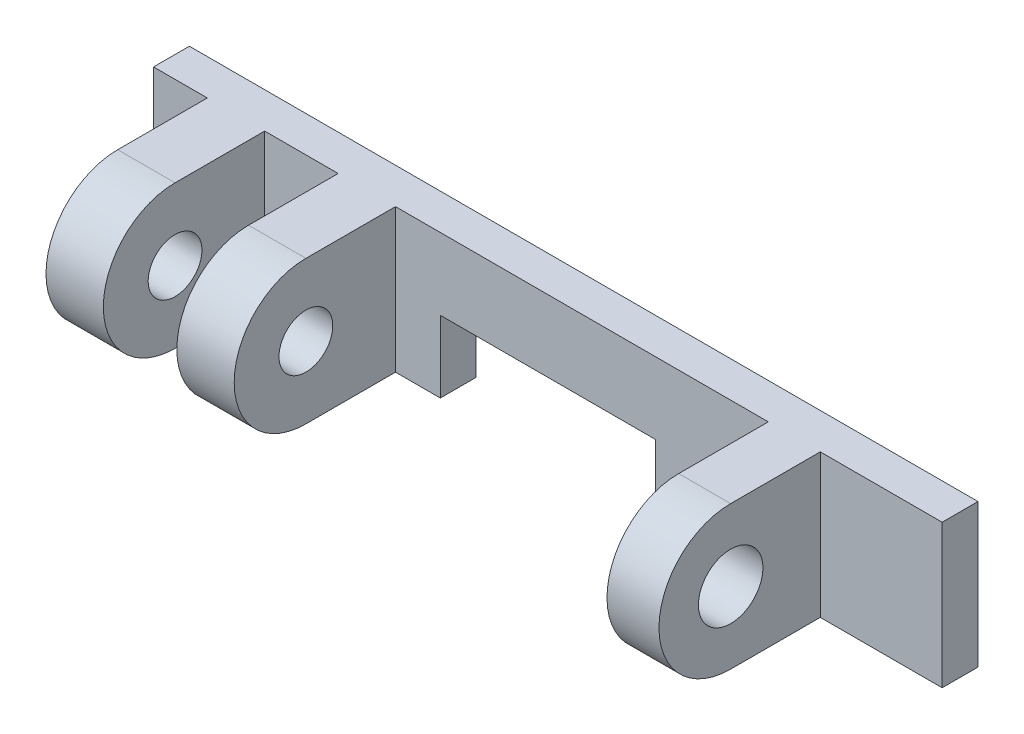
ISO-10303-21;
HEADER;
FILE_DESCRIPTION(('STEP AP214'),'2;1');
FILE_NAME('part.step','',(''),(''),'','','');
FILE_SCHEMA(('AUTOMOTIVE_DESIGN { 1 0 10303 214 1 1 1 1 }'));
ENDSEC;
DATA;
#1=APPLICATION_CONTEXT('core data for automotive mechanical design processes');
#2=APPLICATION_PROTOCOL_DEFINITION('international standard','automotive_design',2000,#1);
#3=PRODUCT_CONTEXT('',#1,'mechanical');
#4=PRODUCT('Part','Part','',(#3));
#5=PRODUCT_RELATED_PRODUCT_CATEGORY('part','',(#4));
#6=PRODUCT_DEFINITION_FORMATION('','',#4);
#7=PRODUCT_DEFINITION_CONTEXT('part definition',#1,'design');
#8=PRODUCT_DEFINITION('design','',#6,#7);
#9=PRODUCT_DEFINITION_SHAPE('','',#8);
#10=(LENGTH_UNIT() NAMED_UNIT(*) SI_UNIT(.MILLI.,.METRE.));
#11=(NAMED_UNIT(*) PLANE_ANGLE_UNIT() SI_UNIT($,.RADIAN.));
#12=(NAMED_UNIT(*) SI_UNIT($,.STERADIAN.) SOLID_ANGLE_UNIT());
#13=UNCERTAINTY_MEASURE_WITH_UNIT(LENGTH_MEASURE(1.E-05),#10,'distance_accuracy_value','');
#14=(GEOMETRIC_REPRESENTATION_CONTEXT(3) GLOBAL_UNCERTAINTY_ASSIGNED_CONTEXT((#13)) GLOBAL_UNIT_ASSIGNED_CONTEXT((#10,
#11,#12)) REPRESENTATION_CONTEXT('',''));
#15=CARTESIAN_POINT('',(0.,0.,0.));
#16=DIRECTION('',(0.,0.,1.));
#17=DIRECTION('',(1.,0.,0.));
#18=AXIS2_PLACEMENT_3D('',#15,#16,#17);
#19=CARTESIAN_POINT('',(-11.,0.,-2.5));
#20=DIRECTION('',(0.,0.,1.));
#21=DIRECTION('',(1.,0.,0.));
#22=AXIS2_PLACEMENT_3D('',#19,#20,#21);
#23=PLANE('',#22);
#24=DIRECTION('',(1.,0.,0.));
#25=VECTOR('',#24,1.);
#26=CARTESIAN_POINT('',(-11.,-2.,-2.5));
#27=LINE('',#26,#25);
#28=CARTESIAN_POINT('',(-4.25,-2.,-2.5));
#29=VERTEX_POINT('',#28);
#30=CARTESIAN_POINT('',(-3.,-2.,-2.5));
#31=VERTEX_POINT('',#30);
#32=EDGE_CURVE('E195',#29,#31,#27,.T.);
#33=ORIENTED_EDGE('',*,*,#32,.T.);
#34=DIRECTION('',(0.,-1.,0.));
#35=VECTOR('',#34,1.);
#36=CARTESIAN_POINT('',(-3.,0.,-2.5));
#37=LINE('',#36,#35);
#38=CARTESIAN_POINT('',(-3.,0.,-2.5));
#39=VERTEX_POINT('',#38);
#40=EDGE_CURVE('E187',#39,#31,#37,.T.);
#41=ORIENTED_EDGE('',*,*,#40,.F.);
#42=DIRECTION('',(1.,0.,0.));
#43=VECTOR('',#42,1.);
#44=CARTESIAN_POINT('',(-3.,0.,-2.5));
#45=LINE('',#44,#43);
#46=CARTESIAN_POINT('',(3.,0.,-2.5));
#47=VERTEX_POINT('',#46);
#48=EDGE_CURVE('E175',#39,#47,#45,.T.);
#49=ORIENTED_EDGE('',*,*,#48,.T.);
#50=DIRECTION('',(0.,-1.,0.));
#51=VECTOR('',#50,1.);
#52=CARTESIAN_POINT('',(3.,0.,-2.5));
#53=LINE('',#52,#51);
#54=CARTESIAN_POINT('',(3.,-2.,-2.5));
#55=VERTEX_POINT('',#54);
#56=EDGE_CURVE('E202',#47,#55,#53,.T.);
#57=ORIENTED_EDGE('',*,*,#56,.T.);
#58=CARTESIAN_POINT('',(6.15,-2.,-2.5));
#59=VERTEX_POINT('',#58);
#60=EDGE_CURVE('E39',#55,#59,#27,.T.);
#61=ORIENTED_EDGE('',*,*,#60,.T.);
#62=DIRECTION('',(0.,-1.,0.));
#63=VECTOR('',#62,1.);
#64=CARTESIAN_POINT('',(6.15,0.,-2.5));
#65=LINE('',#64,#63);
#66=CARTESIAN_POINT('',(6.15,2.,-2.5));
#67=VERTEX_POINT('',#66);
#68=EDGE_CURVE('E61',#67,#59,#65,.T.);
#69=ORIENTED_EDGE('',*,*,#68,.F.);
#70=DIRECTION('',(1.,0.,0.));
#71=VECTOR('',#70,1.);
#72=CARTESIAN_POINT('',(-11.,2.,-2.5));
#73=LINE('',#72,#71);
#74=CARTESIAN_POINT('',(-4.25,2.,-2.5));
#75=VERTEX_POINT('',#74);
#76=EDGE_CURVE('E302',#75,#67,#73,.T.);
#77=ORIENTED_EDGE('',*,*,#76,.F.);
#78=DIRECTION('',(0.,-1.,0.));
#79=VECTOR('',#78,1.);
#80=CARTESIAN_POINT('',(-4.25,0.,-2.5));
#81=LINE('',#80,#79);
#82=EDGE_CURVE('E247',#75,#29,#81,.T.);
#83=ORIENTED_EDGE('',*,*,#82,.T.);
#84=EDGE_LOOP('',(#33,#41,#49,#57,#61,#69,#77,#83));
#85=FACE_BOUND('',#84,.T.);
#86=ADVANCED_FACE('F35',(#85),#23,.T.);
#87=CARTESIAN_POINT('',(-7.9,-2.,0.));
#88=DIRECTION('',(0.,-1.,0.));
#89=DIRECTION('',(0.,0.,-1.));
#90=AXIS2_PLACEMENT_3D('',#87,#88,#89);
#91=PLANE('',#90);
#92=DIRECTION('',(1.,0.,0.));
#93=VECTOR('',#92,1.);
#94=CARTESIAN_POINT('',(-11.,-2.,-3.5));
#95=LINE('',#94,#93);
#96=CARTESIAN_POINT('',(-11.,-2.,-3.5));
#97=VERTEX_POINT('',#96);
#98=CARTESIAN_POINT('',(-3.,-2.,-3.5));
#99=VERTEX_POINT('',#98);
#100=EDGE_CURVE('E311',#97,#99,#95,.T.);
#101=ORIENTED_EDGE('',*,*,#100,.T.);
#102=DIRECTION('',(0.,0.,1.));
#103=VECTOR('',#102,1.);
#104=CARTESIAN_POINT('',(-3.,-2.,0.));
#105=LINE('',#104,#103);
#106=EDGE_CURVE('E196',#99,#31,#105,.T.);
#107=ORIENTED_EDGE('',*,*,#106,.T.);
#108=ORIENTED_EDGE('',*,*,#32,.F.);
#109=DIRECTION('',(0.,0.,1.));
#110=VECTOR('',#109,1.);
#111=CARTESIAN_POINT('',(-4.25,-2.,0.));
#112=LINE('',#111,#110);
#113=CARTESIAN_POINT('',(-4.25,-2.,0.));
#114=VERTEX_POINT('',#113);
#115=EDGE_CURVE('E244',#29,#114,#112,.T.);
#116=ORIENTED_EDGE('',*,*,#115,.T.);
#117=DIRECTION('',(-1.,0.,0.));
#118=VECTOR('',#117,1.);
#119=CARTESIAN_POINT('',(-4.25,-2.,0.));
#120=LINE('',#119,#118);
#121=CARTESIAN_POINT('',(-5.85,-2.,0.));
#122=VERTEX_POINT('',#121);
#123=EDGE_CURVE('E252',#114,#122,#120,.T.);
#124=ORIENTED_EDGE('',*,*,#123,.T.);
#125=DIRECTION('',(0.,0.,1.));
#126=VECTOR('',#125,1.);
#127=CARTESIAN_POINT('',(-5.85,-2.,0.));
#128=LINE('',#127,#126);
#129=CARTESIAN_POINT('',(-5.85,-2.,-2.5));
#130=VERTEX_POINT('',#129);
#131=EDGE_CURVE('E257',#130,#122,#128,.T.);
#132=ORIENTED_EDGE('',*,*,#131,.F.);
#133=CARTESIAN_POINT('',(-7.9,-2.,-2.5));
#134=VERTEX_POINT('',#133);
#135=EDGE_CURVE('E309',#134,#130,#27,.T.);
#136=ORIENTED_EDGE('',*,*,#135,.F.);
#137=DIRECTION('',(0.,0.,1.));
#138=VECTOR('',#137,1.);
#139=CARTESIAN_POINT('',(-7.9,-2.,0.));
#140=LINE('',#139,#138);
#141=CARTESIAN_POINT('',(-7.9,-2.,0.));
#142=VERTEX_POINT('',#141);
#143=EDGE_CURVE('E338',#134,#142,#140,.T.);
#144=ORIENTED_EDGE('',*,*,#143,.T.);
#145=DIRECTION('',(-1.,0.,0.));
#146=VECTOR('',#145,1.);
#147=CARTESIAN_POINT('',(-7.9,-2.,0.));
#148=LINE('',#147,#146);
#149=CARTESIAN_POINT('',(-9.5,-2.,0.));
#150=VERTEX_POINT('',#149);
#151=EDGE_CURVE('E45',#142,#150,#148,.T.);
#152=ORIENTED_EDGE('',*,*,#151,.T.);
#153=DIRECTION('',(0.,0.,1.));
#154=VECTOR('',#153,1.);
#155=CARTESIAN_POINT('',(-9.5,-2.,0.));
#156=LINE('',#155,#154);
#157=CARTESIAN_POINT('',(-9.5,-2.,-2.5));
#158=VERTEX_POINT('',#157);
#159=EDGE_CURVE('E359',#158,#150,#156,.T.);
#160=ORIENTED_EDGE('',*,*,#159,.F.);
#161=CARTESIAN_POINT('',(-11.,-2.,-2.5));
#162=VERTEX_POINT('',#161);
#163=EDGE_CURVE('E318',#162,#158,#27,.T.);
#164=ORIENTED_EDGE('',*,*,#163,.F.);
#165=DIRECTION('',(0.,0.,1.));
#166=VECTOR('',#165,1.);
#167=CARTESIAN_POINT('',(-11.,-2.,0.));
#168=LINE('',#167,#166);
#169=EDGE_CURVE('E272',#97,#162,#168,.T.);
#170=ORIENTED_EDGE('',*,*,#169,.F.);
#171=EDGE_LOOP('',(#101,#107,#108,#116,#124,#132,#136,#144,#152,#160,#164,#170));
#172=FACE_BOUND('',#171,.T.);
#173=ADVANCED_FACE('F337',(#172),#91,.T.);
#174=CARTESIAN_POINT('',(-11.,0.,-3.5));
#175=DIRECTION('',(0.,0.,1.));
#176=DIRECTION('',(1.,0.,0.));
#177=AXIS2_PLACEMENT_3D('',#174,#175,#176);
#178=PLANE('',#177);
#179=DIRECTION('',(0.,-1.,0.));
#180=VECTOR('',#179,1.);
#181=CARTESIAN_POINT('',(-3.,0.,-3.5));
#182=LINE('',#181,#180);
#183=CARTESIAN_POINT('',(-3.,0.,-3.5));
#184=VERTEX_POINT('',#183);
#185=EDGE_CURVE('E183',#184,#99,#182,.T.);
#186=ORIENTED_EDGE('',*,*,#185,.T.);
#187=ORIENTED_EDGE('',*,*,#100,.F.);
#188=DIRECTION('',(0.,-1.,0.));
#189=VECTOR('',#188,1.);
#190=CARTESIAN_POINT('',(-11.,0.,-3.5));
#191=LINE('',#190,#189);
#192=CARTESIAN_POINT('',(-11.,2.,-3.5));
#193=VERTEX_POINT('',#192);
#194=EDGE_CURVE('E275',#193,#97,#191,.T.);
#195=ORIENTED_EDGE('',*,*,#194,.F.);
#196=DIRECTION('',(1.,0.,0.));
#197=VECTOR('',#196,1.);
#198=CARTESIAN_POINT('',(-11.,2.,-3.5));
#199=LINE('',#198,#197);
#200=CARTESIAN_POINT('',(11.,2.,-3.5));
#201=VERTEX_POINT('',#200);
#202=EDGE_CURVE('E291',#193,#201,#199,.T.);
#203=ORIENTED_EDGE('',*,*,#202,.T.);
#204=DIRECTION('',(0.,-1.,0.));
#205=VECTOR('',#204,1.);
#206=CARTESIAN_POINT('',(11.,0.,-3.5));
#207=LINE('',#206,#205);
#208=CARTESIAN_POINT('',(11.,-2.,-3.5));
#209=VERTEX_POINT('',#208);
#210=EDGE_CURVE('E285',#201,#209,#207,.T.);
#211=ORIENTED_EDGE('',*,*,#210,.T.);
#212=CARTESIAN_POINT('',(3.,-2.,-3.5));
#213=VERTEX_POINT('',#212);
#214=EDGE_CURVE('E320',#213,#209,#95,.T.);
#215=ORIENTED_EDGE('',*,*,#214,.F.);
#216=DIRECTION('',(0.,-1.,0.));
#217=VECTOR('',#216,1.);
#218=CARTESIAN_POINT('',(3.,0.,-3.5));
#219=LINE('',#218,#217);
#220=CARTESIAN_POINT('',(3.,0.,-3.5));
#221=VERTEX_POINT('',#220);
#222=EDGE_CURVE('E190',#221,#213,#219,.T.);
#223=ORIENTED_EDGE('',*,*,#222,.F.);
#224=DIRECTION('',(1.,0.,0.));
#225=VECTOR('',#224,1.);
#226=CARTESIAN_POINT('',(-3.,0.,-3.5));
#227=LINE('',#226,#225);
#228=EDGE_CURVE('E182',#184,#221,#227,.T.);
#229=ORIENTED_EDGE('',*,*,#228,.F.);
#230=EDGE_LOOP('',(#186,#187,#195,#203,#211,#215,#223,#229));
#231=FACE_BOUND('',#230,.T.);
#232=ADVANCED_FACE('F407',(#231),#178,.F.);
#233=ORIENTED_EDGE('',*,*,#135,.T.);
#234=DIRECTION('',(0.,-1.,0.));
#235=VECTOR('',#234,1.);
#236=CARTESIAN_POINT('',(-5.85,0.,-2.5));
#237=LINE('',#236,#235);
#238=CARTESIAN_POINT('',(-5.85,2.,-2.5));
#239=VERTEX_POINT('',#238);
#240=EDGE_CURVE('E260',#239,#130,#237,.T.);
#241=ORIENTED_EDGE('',*,*,#240,.F.);
#242=CARTESIAN_POINT('',(-7.9,2.,-2.5));
#243=VERTEX_POINT('',#242);
#244=EDGE_CURVE('E296',#243,#239,#73,.T.);
#245=ORIENTED_EDGE('',*,*,#244,.F.);
#246=DIRECTION('',(0.,-1.,0.));
#247=VECTOR('',#246,1.);
#248=CARTESIAN_POINT('',(-7.9,0.,-2.5));
#249=LINE('',#248,#247);
#250=EDGE_CURVE('E333',#243,#134,#249,.T.);
#251=ORIENTED_EDGE('',*,*,#250,.T.);
#252=EDGE_LOOP('',(#233,#241,#245,#251));
#253=FACE_BOUND('',#252,.T.);
#254=ADVANCED_FACE('F329',(#253),#23,.T.);
#255=CARTESIAN_POINT('',(-7.9,2.,0.));
#256=DIRECTION('',(0.,1.,0.));
#257=DIRECTION('',(0.,0.,1.));
#258=AXIS2_PLACEMENT_3D('',#255,#256,#257);
#259=PLANE('',#258);
#260=DIRECTION('',(0.,0.,-1.));
#261=VECTOR('',#260,1.);
#262=CARTESIAN_POINT('',(-9.5,2.,0.));
#263=LINE('',#262,#261);
#264=CARTESIAN_POINT('',(-9.5,2.,0.));
#265=VERTEX_POINT('',#264);
#266=CARTESIAN_POINT('',(-9.5,2.,-2.5));
#267=VERTEX_POINT('',#266);
#268=EDGE_CURVE('E351',#265,#267,#263,.T.);
#269=ORIENTED_EDGE('',*,*,#268,.F.);
#270=DIRECTION('',(-1.,0.,0.));
#271=VECTOR('',#270,1.);
#272=CARTESIAN_POINT('',(-7.9,2.,0.));
#273=LINE('',#272,#271);
#274=CARTESIAN_POINT('',(-7.9,2.,0.));
#275=VERTEX_POINT('',#274);
#276=EDGE_CURVE('E11',#275,#265,#273,.T.);
#277=ORIENTED_EDGE('',*,*,#276,.F.);
#278=DIRECTION('',(0.,0.,-1.));
#279=VECTOR('',#278,1.);
#280=CARTESIAN_POINT('',(-7.9,2.,0.));
#281=LINE('',#280,#279);
#282=EDGE_CURVE('E349',#275,#243,#281,.T.);
#283=ORIENTED_EDGE('',*,*,#282,.T.);
#284=ORIENTED_EDGE('',*,*,#244,.T.);
#285=DIRECTION('',(0.,0.,-1.));
#286=VECTOR('',#285,1.);
#287=CARTESIAN_POINT('',(-5.85,2.,0.));
#288=LINE('',#287,#286);
#289=CARTESIAN_POINT('',(-5.85,2.,0.));
#290=VERTEX_POINT('',#289);
#291=EDGE_CURVE('E237',#290,#239,#288,.T.);
#292=ORIENTED_EDGE('',*,*,#291,.F.);
#293=DIRECTION('',(-1.,0.,0.));
#294=VECTOR('',#293,1.);
#295=CARTESIAN_POINT('',(-4.25,2.,0.));
#296=LINE('',#295,#294);
#297=CARTESIAN_POINT('',(-4.25,2.,0.));
#298=VERTEX_POINT('',#297);
#299=EDGE_CURVE('E266',#298,#290,#296,.T.);
#300=ORIENTED_EDGE('',*,*,#299,.F.);
#301=DIRECTION('',(0.,0.,-1.));
#302=VECTOR('',#301,1.);
#303=CARTESIAN_POINT('',(-4.25,2.,0.));
#304=LINE('',#303,#302);
#305=EDGE_CURVE('E239',#298,#75,#304,.T.);
#306=ORIENTED_EDGE('',*,*,#305,.T.);
#307=ORIENTED_EDGE('',*,*,#76,.T.);
#308=DIRECTION('',(0.,0.,-1.));
#309=VECTOR('',#308,1.);
#310=CARTESIAN_POINT('',(6.15,2.,0.));
#311=LINE('',#310,#309);
#312=CARTESIAN_POINT('',(6.15,2.,0.));
#313=VERTEX_POINT('',#312);
#314=EDGE_CURVE('E209',#313,#67,#311,.T.);
#315=ORIENTED_EDGE('',*,*,#314,.F.);
#316=DIRECTION('',(1.,0.,0.));
#317=VECTOR('',#316,1.);
#318=CARTESIAN_POINT('',(6.15,2.,0.));
#319=LINE('',#318,#317);
#320=CARTESIAN_POINT('',(7.6,2.,0.));
#321=VERTEX_POINT('',#320);
#322=EDGE_CURVE('E222',#313,#321,#319,.T.);
#323=ORIENTED_EDGE('',*,*,#322,.T.);
#324=DIRECTION('',(0.,0.,-1.));
#325=VECTOR('',#324,1.);
#326=CARTESIAN_POINT('',(7.6,2.,0.));
#327=LINE('',#326,#325);
#328=CARTESIAN_POINT('',(7.6,2.,-2.5));
#329=VERTEX_POINT('',#328);
#330=EDGE_CURVE('E207',#321,#329,#327,.T.);
#331=ORIENTED_EDGE('',*,*,#330,.T.);
#332=CARTESIAN_POINT('',(11.,2.,-2.5));
#333=VERTEX_POINT('',#332);
#334=EDGE_CURVE('E305',#329,#333,#73,.T.);
#335=ORIENTED_EDGE('',*,*,#334,.T.);
#336=DIRECTION('',(0.,0.,-1.));
#337=VECTOR('',#336,1.);
#338=CARTESIAN_POINT('',(11.,2.,0.));
#339=LINE('',#338,#337);
#340=EDGE_CURVE('E273',#333,#201,#339,.T.);
#341=ORIENTED_EDGE('',*,*,#340,.T.);
#342=ORIENTED_EDGE('',*,*,#202,.F.);
#343=DIRECTION('',(0.,0.,-1.));
#344=VECTOR('',#343,1.);
#345=CARTESIAN_POINT('',(-11.,2.,0.));
#346=LINE('',#345,#344);
#347=CARTESIAN_POINT('',(-11.,2.,-2.5));
#348=VERTEX_POINT('',#347);
#349=EDGE_CURVE('E277',#348,#193,#346,.T.);
#350=ORIENTED_EDGE('',*,*,#349,.F.);
#351=EDGE_CURVE('E300',#348,#267,#73,.T.);
#352=ORIENTED_EDGE('',*,*,#351,.T.);
#353=EDGE_LOOP('',(#269,#277,#283,#284,#292,#300,#306,#307,#315,#323,#331,#335,#341,#342,#350,#352));
#354=FACE_BOUND('',#353,.T.);
#355=ADVANCED_FACE('F37',(#354),#259,.T.);
#356=CARTESIAN_POINT('',(-7.9,0.,0.));
#357=DIRECTION('',(-1.,0.,0.));
#358=DIRECTION('',(0.,0.,1.));
#359=AXIS2_PLACEMENT_3D('',#356,#357,#358);
#360=CYLINDRICAL_SURFACE('',#359,2.);
#361=CARTESIAN_POINT('',(-9.5,0.,0.));
#362=DIRECTION('',(1.,0.,0.));
#363=DIRECTION('',(0.,0.,-1.));
#364=AXIS2_PLACEMENT_3D('',#361,#362,#363);
#365=CIRCLE('',#364,2.);
#366=EDGE_CURVE('E353',#265,#150,#365,.T.);
#367=ORIENTED_EDGE('',*,*,#366,.T.);
#368=ORIENTED_EDGE('',*,*,#151,.F.);
#369=CARTESIAN_POINT('',(-7.9,0.,0.));
#370=DIRECTION('',(1.,0.,0.));
#371=DIRECTION('',(0.,0.,-1.));
#372=AXIS2_PLACEMENT_3D('',#369,#370,#371);
#373=CIRCLE('',#372,2.);
#374=EDGE_CURVE('E381',#275,#142,#373,.T.);
#375=ORIENTED_EDGE('',*,*,#374,.F.);
#376=ORIENTED_EDGE('',*,*,#276,.T.);
#377=EDGE_LOOP('',(#367,#368,#375,#376));
#378=FACE_BOUND('',#377,.T.);
#379=ADVANCED_FACE('F464',(#378),#360,.T.);
#380=DIRECTION('',(0.,0.,1.));
#381=VECTOR('',#380,1.);
#382=CARTESIAN_POINT('',(3.,-2.,0.));
#383=LINE('',#382,#381);
#384=EDGE_CURVE('E204',#213,#55,#383,.T.);
#385=ORIENTED_EDGE('',*,*,#384,.F.);
#386=ORIENTED_EDGE('',*,*,#214,.T.);
#387=DIRECTION('',(0.,0.,1.));
#388=VECTOR('',#387,1.);
#389=CARTESIAN_POINT('',(11.,-2.,0.));
#390=LINE('',#389,#388);
#391=CARTESIAN_POINT('',(11.,-2.,-2.5));
#392=VERTEX_POINT('',#391);
#393=EDGE_CURVE('E282',#209,#392,#390,.T.);
#394=ORIENTED_EDGE('',*,*,#393,.T.);
#395=CARTESIAN_POINT('',(7.6,-2.,-2.5));
#396=VERTEX_POINT('',#395);
#397=EDGE_CURVE('E279',#396,#392,#27,.T.);
#398=ORIENTED_EDGE('',*,*,#397,.F.);
#399=DIRECTION('',(0.,0.,1.));
#400=VECTOR('',#399,1.);
#401=CARTESIAN_POINT('',(7.6,-2.,0.));
#402=LINE('',#401,#400);
#403=CARTESIAN_POINT('',(7.6,-2.,0.));
#404=VERTEX_POINT('',#403);
#405=EDGE_CURVE('E228',#396,#404,#402,.T.);
#406=ORIENTED_EDGE('',*,*,#405,.T.);
#407=DIRECTION('',(1.,0.,0.));
#408=VECTOR('',#407,1.);
#409=CARTESIAN_POINT('',(6.15,-2.,0.));
#410=LINE('',#409,#408);
#411=CARTESIAN_POINT('',(6.15,-2.,0.));
#412=VERTEX_POINT('',#411);
#413=EDGE_CURVE('E235',#412,#404,#410,.T.);
#414=ORIENTED_EDGE('',*,*,#413,.F.);
#415=DIRECTION('',(0.,0.,1.));
#416=VECTOR('',#415,1.);
#417=CARTESIAN_POINT('',(6.15,-2.,0.));
#418=LINE('',#417,#416);
#419=EDGE_CURVE('E216',#59,#412,#418,.T.);
#420=ORIENTED_EDGE('',*,*,#419,.F.);
#421=ORIENTED_EDGE('',*,*,#60,.F.);
#422=EDGE_LOOP('',(#385,#386,#394,#398,#406,#414,#420,#421));
#423=FACE_BOUND('',#422,.T.);
#424=ADVANCED_FACE('F399',(#423),#91,.T.);
#425=CARTESIAN_POINT('',(-7.9,0.,0.));
#426=DIRECTION('',(-1.,0.,0.));
#427=DIRECTION('',(0.,0.,1.));
#428=AXIS2_PLACEMENT_3D('',#425,#426,#427);
#429=CYLINDRICAL_SURFACE('',#428,0.75);
#430=CARTESIAN_POINT('',(-7.9,0.,0.));
#431=DIRECTION('',(1.,0.,0.));
#432=DIRECTION('',(0.,0.,-1.));
#433=AXIS2_PLACEMENT_3D('',#430,#431,#432);
#434=CIRCLE('',#433,0.75);
#435=CARTESIAN_POINT('',(-7.9,0.,0.75));
#436=VERTEX_POINT('',#435);
#437=EDGE_CURVE('E375',#436,#436,#434,.T.);
#438=CARTESIAN_POINT('',(-9.5,0.,0.));
#439=DIRECTION('',(1.,0.,0.));
#440=DIRECTION('',(0.,0.,-1.));
#441=AXIS2_PLACEMENT_3D('',#438,#439,#440);
#442=CIRCLE('',#441,0.75);
#443=CARTESIAN_POINT('',(-9.5,0.,0.75));
#444=VERTEX_POINT('',#443);
#445=EDGE_CURVE('E369',#444,#444,#442,.T.);
#446=CARTESIAN_POINT('',(-7.9,0.,0.75));
#447=CARTESIAN_POINT('',(-7.91666666666667,0.,0.75));
#448=CARTESIAN_POINT('',(-7.93333333333333,0.,0.75));
#449=CARTESIAN_POINT('',(-7.96666666666667,0.,0.75));
#450=CARTESIAN_POINT('',(-7.98333333333333,0.,0.75));
#451=CARTESIAN_POINT('',(-8.01666666666667,0.,0.75));
#452=CARTESIAN_POINT('',(-8.03333333333333,0.,0.75));
#453=CARTESIAN_POINT('',(-8.06666666666667,0.,0.75));
#454=CARTESIAN_POINT('',(-8.08333333333333,0.,0.75));
#455=CARTESIAN_POINT('',(-8.11666666666667,0.,0.75));
#456=CARTESIAN_POINT('',(-8.13333333333333,0.,0.75));
#457=CARTESIAN_POINT('',(-8.16666666666667,0.,0.75));
#458=CARTESIAN_POINT('',(-8.18333333333333,0.,0.75));
#459=CARTESIAN_POINT('',(-8.21666666666667,0.,0.75));
#460=CARTESIAN_POINT('',(-8.23333333333333,0.,0.75));
#461=CARTESIAN_POINT('',(-8.26666666666667,0.,0.75));
#462=CARTESIAN_POINT('',(-8.28333333333333,0.,0.75));
#463=CARTESIAN_POINT('',(-8.31666666666667,0.,0.75));
#464=CARTESIAN_POINT('',(-8.33333333333333,0.,0.75));
#465=CARTESIAN_POINT('',(-8.36666666666667,0.,0.75));
#466=CARTESIAN_POINT('',(-8.38333333333333,0.,0.75));
#467=CARTESIAN_POINT('',(-8.41666666666667,0.,0.75));
#468=CARTESIAN_POINT('',(-8.43333333333333,0.,0.75));
#469=CARTESIAN_POINT('',(-8.46666666666667,0.,0.75));
#470=CARTESIAN_POINT('',(-8.48333333333333,0.,0.75));
#471=CARTESIAN_POINT('',(-8.51666666666667,0.,0.75));
#472=CARTESIAN_POINT('',(-8.53333333333333,0.,0.75));
#473=CARTESIAN_POINT('',(-8.56666666666667,0.,0.75));
#474=CARTESIAN_POINT('',(-8.58333333333333,0.,0.75));
#475=CARTESIAN_POINT('',(-8.61666666666667,0.,0.75));
#476=CARTESIAN_POINT('',(-8.63333333333333,0.,0.75));
#477=CARTESIAN_POINT('',(-8.66666666666667,0.,0.75));
#478=CARTESIAN_POINT('',(-8.68333333333333,0.,0.75));
#479=CARTESIAN_POINT('',(-8.71666666666667,0.,0.75));
#480=CARTESIAN_POINT('',(-8.73333333333333,0.,0.75));
#481=CARTESIAN_POINT('',(-8.76666666666667,0.,0.75));
#482=CARTESIAN_POINT('',(-8.78333333333333,0.,0.75));
#483=CARTESIAN_POINT('',(-8.81666666666666,0.,0.75));
#484=CARTESIAN_POINT('',(-8.83333333333333,0.,0.75));
#485=CARTESIAN_POINT('',(-8.86666666666667,0.,0.75));
#486=CARTESIAN_POINT('',(-8.88333333333333,0.,0.75));
#487=CARTESIAN_POINT('',(-8.91666666666667,0.,0.75));
#488=CARTESIAN_POINT('',(-8.93333333333333,0.,0.75));
#489=CARTESIAN_POINT('',(-8.96666666666667,0.,0.75));
#490=CARTESIAN_POINT('',(-8.98333333333333,0.,0.75));
#491=CARTESIAN_POINT('',(-9.01666666666667,0.,0.75));
#492=CARTESIAN_POINT('',(-9.03333333333333,0.,0.75));
#493=CARTESIAN_POINT('',(-9.06666666666667,0.,0.75));
#494=CARTESIAN_POINT('',(-9.08333333333333,0.,0.75));
#495=CARTESIAN_POINT('',(-9.11666666666667,0.,0.75));
#496=CARTESIAN_POINT('',(-9.13333333333333,0.,0.75));
#497=CARTESIAN_POINT('',(-9.16666666666666,0.,0.75));
#498=CARTESIAN_POINT('',(-9.18333333333333,0.,0.75));
#499=CARTESIAN_POINT('',(-9.21666666666667,0.,0.75));
#500=CARTESIAN_POINT('',(-9.23333333333333,0.,0.75));
#501=CARTESIAN_POINT('',(-9.26666666666667,0.,0.75));
#502=CARTESIAN_POINT('',(-9.28333333333333,0.,0.75));
#503=CARTESIAN_POINT('',(-9.31666666666667,0.,0.75));
#504=CARTESIAN_POINT('',(-9.33333333333333,0.,0.75));
#505=CARTESIAN_POINT('',(-9.36666666666667,0.,0.75));
#506=CARTESIAN_POINT('',(-9.38333333333333,0.,0.75));
#507=CARTESIAN_POINT('',(-9.41666666666667,0.,0.75));
#508=CARTESIAN_POINT('',(-9.43333333333333,0.,0.75));
#509=CARTESIAN_POINT('',(-9.46666666666667,0.,0.75));
#510=CARTESIAN_POINT('',(-9.48333333333333,0.,0.75));
#511=CARTESIAN_POINT('',(-9.5,0.,0.75));
#512=B_SPLINE_CURVE_WITH_KNOTS('',3,(#446,#447,#448,#449,#450,#451,#452,#453,#454,#455,#456,
#457,#458,#459,#460,#461,#462,#463,#464,#465,#466,#467,#468,#469,#470,#471,#472,#473,#474,#475,
#476,#477,#478,#479,#480,#481,#482,#483,#484,#485,#486,#487,#488,#489,#490,#491,#492,#493,#494,
#495,#496,#497,#498,#499,#500,#501,#502,#503,#504,#505,#506,#507,#508,#509,#510,#511),
.UNSPECIFIED.,.F.,.F.,(4,2,2,2,2,2,2,2,2,2,2,2,2,2,2,2,2,2,2,2,2,2,2,2,2,2,2,2,2,2,2,2,4),(0.,
0.0500000000000014,0.100000000000001,0.150000000000001,0.200000000000001,0.25,0.3,
0.350000000000001,0.400000000000001,0.450000000000001,0.5,0.55,0.6,0.650000000000001,
0.700000000000001,0.750000000000001,0.8,0.85,0.9,0.950000000000001,1.,1.05,1.1,1.15,1.2,1.25,
1.3,1.35,1.4,1.45,1.5,1.55,1.6),.UNSPECIFIED.);
#513=EDGE_CURVE('BSEAM385',#436,#444,#512,.T.);
#514=ORIENTED_EDGE('',*,*,#437,.T.);
#515=ORIENTED_EDGE('',*,*,#445,.F.);
#516=ORIENTED_EDGE('',*,*,#513,.T.);
#517=ORIENTED_EDGE('',*,*,#513,.F.);
#518=EDGE_LOOP('',(#514,#516,#515,#517));
#519=FACE_BOUND('',#518,.T.);
#520=ADVANCED_FACE('F385',(#519),#429,.F.);
#521=CARTESIAN_POINT('',(-7.9,0.,0.));
#522=DIRECTION('',(1.,0.,0.));
#523=DIRECTION('',(0.,0.,-1.));
#524=AXIS2_PLACEMENT_3D('',#521,#522,#523);
#525=PLANE('',#524);
#526=ORIENTED_EDGE('',*,*,#282,.F.);
#527=ORIENTED_EDGE('',*,*,#374,.T.);
#528=ORIENTED_EDGE('',*,*,#143,.F.);
#529=ORIENTED_EDGE('',*,*,#250,.F.);
#530=EDGE_LOOP('',(#526,#527,#528,#529));
#531=FACE_BOUND('',#530,.T.);
#532=ORIENTED_EDGE('',*,*,#437,.F.);
#533=EDGE_LOOP('',(#532));
#534=FACE_BOUND('',#533,.T.);
#535=ADVANCED_FACE('F388',(#531,#534),#525,.T.);
#536=CARTESIAN_POINT('',(-9.5,0.,0.));
#537=DIRECTION('',(1.,0.,0.));
#538=DIRECTION('',(0.,0.,-1.));
#539=AXIS2_PLACEMENT_3D('',#536,#537,#538);
#540=PLANE('',#539);
#541=ORIENTED_EDGE('',*,*,#268,.T.);
#542=DIRECTION('',(0.,-1.,0.));
#543=VECTOR('',#542,1.);
#544=CARTESIAN_POINT('',(-9.5,0.,-2.5));
#545=LINE('',#544,#543);
#546=EDGE_CURVE('E367',#267,#158,#545,.T.);
#547=ORIENTED_EDGE('',*,*,#546,.T.);
#548=ORIENTED_EDGE('',*,*,#159,.T.);
#549=ORIENTED_EDGE('',*,*,#366,.F.);
#550=EDGE_LOOP('',(#541,#547,#548,#549));
#551=FACE_BOUND('',#550,.T.);
#552=ORIENTED_EDGE('',*,*,#445,.T.);
#553=EDGE_LOOP('',(#552));
#554=FACE_BOUND('',#553,.T.);
#555=ADVANCED_FACE('F390',(#551,#554),#540,.F.);
#556=ORIENTED_EDGE('',*,*,#546,.F.);
#557=ORIENTED_EDGE('',*,*,#351,.F.);
#558=DIRECTION('',(0.,-1.,0.));
#559=VECTOR('',#558,1.);
#560=CARTESIAN_POINT('',(-11.,0.,-2.5));
#561=LINE('',#560,#559);
#562=EDGE_CURVE('E269',#348,#162,#561,.T.);
#563=ORIENTED_EDGE('',*,*,#562,.T.);
#564=ORIENTED_EDGE('',*,*,#163,.T.);
#565=EDGE_LOOP('',(#556,#557,#563,#564));
#566=FACE_BOUND('',#565,.T.);
#567=ADVANCED_FACE('F397',(#566),#23,.T.);
#568=DIRECTION('',(0.,-1.,0.));
#569=VECTOR('',#568,1.);
#570=CARTESIAN_POINT('',(7.6,0.,-2.5));
#571=LINE('',#570,#569);
#572=EDGE_CURVE('E231',#329,#396,#571,.T.);
#573=ORIENTED_EDGE('',*,*,#572,.T.);
#574=ORIENTED_EDGE('',*,*,#397,.T.);
#575=DIRECTION('',(0.,-1.,0.));
#576=VECTOR('',#575,1.);
#577=CARTESIAN_POINT('',(11.,0.,-2.5));
#578=LINE('',#577,#576);
#579=EDGE_CURVE('E268',#333,#392,#578,.T.);
#580=ORIENTED_EDGE('',*,*,#579,.F.);
#581=ORIENTED_EDGE('',*,*,#334,.F.);
#582=EDGE_LOOP('',(#573,#574,#580,#581));
#583=FACE_BOUND('',#582,.T.);
#584=ADVANCED_FACE('F403',(#583),#23,.T.);
#585=CARTESIAN_POINT('',(-11.,0.,0.));
#586=DIRECTION('',(1.,0.,0.));
#587=DIRECTION('',(0.,0.,-1.));
#588=AXIS2_PLACEMENT_3D('',#585,#586,#587);
#589=PLANE('',#588);
#590=ORIENTED_EDGE('',*,*,#562,.F.);
#591=ORIENTED_EDGE('',*,*,#349,.T.);
#592=ORIENTED_EDGE('',*,*,#194,.T.);
#593=ORIENTED_EDGE('',*,*,#169,.T.);
#594=EDGE_LOOP('',(#590,#591,#592,#593));
#595=FACE_BOUND('',#594,.T.);
#596=ADVANCED_FACE('F412',(#595),#589,.F.);
#597=CARTESIAN_POINT('',(11.,0.,0.));
#598=DIRECTION('',(1.,0.,0.));
#599=DIRECTION('',(0.,0.,-1.));
#600=AXIS2_PLACEMENT_3D('',#597,#598,#599);
#601=PLANE('',#600);
#602=ORIENTED_EDGE('',*,*,#579,.T.);
#603=ORIENTED_EDGE('',*,*,#393,.F.);
#604=ORIENTED_EDGE('',*,*,#210,.F.);
#605=ORIENTED_EDGE('',*,*,#340,.F.);
#606=EDGE_LOOP('',(#602,#603,#604,#605));
#607=FACE_BOUND('',#606,.T.);
#608=ADVANCED_FACE('F418',(#607),#601,.T.);
#609=CARTESIAN_POINT('',(-4.25,0.,0.));
#610=DIRECTION('',(-1.,0.,0.));
#611=DIRECTION('',(0.,0.,1.));
#612=AXIS2_PLACEMENT_3D('',#609,#610,#611);
#613=CYLINDRICAL_SURFACE('',#612,2.);
#614=CARTESIAN_POINT('',(-5.85,0.,0.));
#615=DIRECTION('',(1.,0.,0.));
#616=DIRECTION('',(0.,0.,-1.));
#617=AXIS2_PLACEMENT_3D('',#614,#615,#616);
#618=CIRCLE('',#617,2.);
#619=EDGE_CURVE('E254',#290,#122,#618,.T.);
#620=ORIENTED_EDGE('',*,*,#619,.T.);
#621=ORIENTED_EDGE('',*,*,#123,.F.);
#622=CARTESIAN_POINT('',(-4.25,0.,0.));
#623=DIRECTION('',(1.,0.,0.));
#624=DIRECTION('',(0.,0.,-1.));
#625=AXIS2_PLACEMENT_3D('',#622,#623,#624);
#626=CIRCLE('',#625,2.);
#627=EDGE_CURVE('E241',#298,#114,#626,.T.);
#628=ORIENTED_EDGE('',*,*,#627,.F.);
#629=ORIENTED_EDGE('',*,*,#299,.T.);
#630=EDGE_LOOP('',(#620,#621,#628,#629));
#631=FACE_BOUND('',#630,.T.);
#632=ADVANCED_FACE('F562',(#631),#613,.T.);
#633=CARTESIAN_POINT('',(-4.25,0.,0.));
#634=DIRECTION('',(-1.,0.,0.));
#635=DIRECTION('',(0.,0.,1.));
#636=AXIS2_PLACEMENT_3D('',#633,#634,#635);
#637=CYLINDRICAL_SURFACE('',#636,0.75);
#638=CARTESIAN_POINT('',(-4.25,0.,0.));
#639=DIRECTION('',(1.,0.,0.));
#640=DIRECTION('',(0.,0.,-1.));
#641=AXIS2_PLACEMENT_3D('',#638,#639,#640);
#642=CIRCLE('',#641,0.75);
#643=CARTESIAN_POINT('',(-4.25,0.,0.75));
#644=VERTEX_POINT('',#643);
#645=EDGE_CURVE('E249',#644,#644,#642,.T.);
#646=CARTESIAN_POINT('',(-5.85,0.,0.));
#647=DIRECTION('',(1.,0.,0.));
#648=DIRECTION('',(0.,0.,-1.));
#649=AXIS2_PLACEMENT_3D('',#646,#647,#648);
#650=CIRCLE('',#649,0.75);
#651=CARTESIAN_POINT('',(-5.85,0.,0.75));
#652=VERTEX_POINT('',#651);
#653=EDGE_CURVE('E242',#652,#652,#650,.T.);
#654=CARTESIAN_POINT('',(-4.25,0.,0.75));
#655=CARTESIAN_POINT('',(-4.26666666666667,0.,0.75));
#656=CARTESIAN_POINT('',(-4.28333333333333,0.,0.75));
#657=CARTESIAN_POINT('',(-4.31666666666667,0.,0.75));
#658=CARTESIAN_POINT('',(-4.33333333333333,0.,0.75));
#659=CARTESIAN_POINT('',(-4.36666666666667,0.,0.75));
#660=CARTESIAN_POINT('',(-4.38333333333333,0.,0.75));
#661=CARTESIAN_POINT('',(-4.41666666666667,0.,0.75));
#662=CARTESIAN_POINT('',(-4.43333333333333,0.,0.75));
#663=CARTESIAN_POINT('',(-4.46666666666667,0.,0.75));
#664=CARTESIAN_POINT('',(-4.48333333333333,0.,0.75));
#665=CARTESIAN_POINT('',(-4.51666666666667,0.,0.75));
#666=CARTESIAN_POINT('',(-4.53333333333333,0.,0.75));
#667=CARTESIAN_POINT('',(-4.56666666666666,0.,0.75));
#668=CARTESIAN_POINT('',(-4.58333333333333,0.,0.75));
#669=CARTESIAN_POINT('',(-4.61666666666667,0.,0.75));
#670=CARTESIAN_POINT('',(-4.63333333333333,0.,0.75));
#671=CARTESIAN_POINT('',(-4.66666666666667,0.,0.75));
#672=CARTESIAN_POINT('',(-4.68333333333333,0.,0.75));
#673=CARTESIAN_POINT('',(-4.71666666666667,0.,0.75));
#674=CARTESIAN_POINT('',(-4.73333333333333,0.,0.75));
#675=CARTESIAN_POINT('',(-4.76666666666667,0.,0.75));
#676=CARTESIAN_POINT('',(-4.78333333333333,0.,0.75));
#677=CARTESIAN_POINT('',(-4.81666666666667,0.,0.75));
#678=CARTESIAN_POINT('',(-4.83333333333333,0.,0.75));
#679=CARTESIAN_POINT('',(-4.86666666666667,0.,0.75));
#680=CARTESIAN_POINT('',(-4.88333333333333,0.,0.75));
#681=CARTESIAN_POINT('',(-4.91666666666667,0.,0.75));
#682=CARTESIAN_POINT('',(-4.93333333333333,0.,0.75));
#683=CARTESIAN_POINT('',(-4.96666666666667,0.,0.75));
#684=CARTESIAN_POINT('',(-4.98333333333333,0.,0.75));
#685=CARTESIAN_POINT('',(-5.01666666666667,0.,0.75));
#686=CARTESIAN_POINT('',(-5.03333333333333,0.,0.75));
#687=CARTESIAN_POINT('',(-5.06666666666667,0.,0.75));
#688=CARTESIAN_POINT('',(-5.08333333333333,0.,0.75));
#689=CARTESIAN_POINT('',(-5.11666666666667,0.,0.75));
#690=CARTESIAN_POINT('',(-5.13333333333333,0.,0.75));
#691=CARTESIAN_POINT('',(-5.16666666666667,0.,0.75));
#692=CARTESIAN_POINT('',(-5.18333333333333,0.,0.75));
#693=CARTESIAN_POINT('',(-5.21666666666667,0.,0.75));
#694=CARTESIAN_POINT('',(-5.23333333333333,0.,0.75));
#695=CARTESIAN_POINT('',(-5.26666666666666,0.,0.75));
#696=CARTESIAN_POINT('',(-5.28333333333333,0.,0.75));
#697=CARTESIAN_POINT('',(-5.31666666666667,0.,0.75));
#698=CARTESIAN_POINT('',(-5.33333333333333,0.,0.75));
#699=CARTESIAN_POINT('',(-5.36666666666667,0.,0.75));
#700=CARTESIAN_POINT('',(-5.38333333333333,0.,0.75));
#701=CARTESIAN_POINT('',(-5.41666666666667,0.,0.75));
#702=CARTESIAN_POINT('',(-5.43333333333333,0.,0.75));
#703=CARTESIAN_POINT('',(-5.46666666666667,0.,0.75));
#704=CARTESIAN_POINT('',(-5.48333333333333,0.,0.75));
#705=CARTESIAN_POINT('',(-5.51666666666667,0.,0.75));
#706=CARTESIAN_POINT('',(-5.53333333333333,0.,0.75));
#707=CARTESIAN_POINT('',(-5.56666666666666,0.,0.75));
#708=CARTESIAN_POINT('',(-5.58333333333333,0.,0.75));
#709=CARTESIAN_POINT('',(-5.61666666666667,0.,0.75));
#710=CARTESIAN_POINT('',(-5.63333333333333,0.,0.75));
#711=CARTESIAN_POINT('',(-5.66666666666667,0.,0.75));
#712=CARTESIAN_POINT('',(-5.68333333333333,0.,0.75));
#713=CARTESIAN_POINT('',(-5.71666666666667,0.,0.75));
#714=CARTESIAN_POINT('',(-5.73333333333333,0.,0.75));
#715=CARTESIAN_POINT('',(-5.76666666666666,0.,0.75));
#716=CARTESIAN_POINT('',(-5.78333333333333,0.,0.75));
#717=CARTESIAN_POINT('',(-5.81666666666667,0.,0.75));
#718=CARTESIAN_POINT('',(-5.83333333333333,0.,0.75));
#719=CARTESIAN_POINT('',(-5.85,0.,0.75));
#720=B_SPLINE_CURVE_WITH_KNOTS('',3,(#654,#655,#656,#657,#658,#659,#660,#661,#662,#663,#664,
#665,#666,#667,#668,#669,#670,#671,#672,#673,#674,#675,#676,#677,#678,#679,#680,#681,#682,#683,
#684,#685,#686,#687,#688,#689,#690,#691,#692,#693,#694,#695,#696,#697,#698,#699,#700,#701,#702,
#703,#704,#705,#706,#707,#708,#709,#710,#711,#712,#713,#714,#715,#716,#717,#718,#719),
.UNSPECIFIED.,.F.,.F.,(4,2,2,2,2,2,2,2,2,2,2,2,2,2,2,2,2,2,2,2,2,2,2,2,2,2,2,2,2,2,2,2,4),(0.,
0.0499999999999997,0.0999999999999994,0.15,0.2,0.249999999999999,0.299999999999999,0.35,
0.399999999999999,0.45,0.5,0.549999999999999,0.599999999999999,0.65,0.699999999999999,0.75,
0.799999999999999,0.849999999999999,0.9,0.95,0.999999999999999,1.05,1.1,1.15,1.2,1.25,1.3,1.35,
1.4,1.45,1.5,1.55,1.6),.UNSPECIFIED.);
#721=EDGE_CURVE('BSEAM552',#644,#652,#720,.T.);
#722=ORIENTED_EDGE('',*,*,#645,.T.);
#723=ORIENTED_EDGE('',*,*,#653,.F.);
#724=ORIENTED_EDGE('',*,*,#721,.T.);
#725=ORIENTED_EDGE('',*,*,#721,.F.);
#726=EDGE_LOOP('',(#722,#724,#723,#725));
#727=FACE_BOUND('',#726,.T.);
#728=ADVANCED_FACE('F552',(#727),#637,.F.);
#729=CARTESIAN_POINT('',(-4.25,0.,0.));
#730=DIRECTION('',(1.,0.,0.));
#731=DIRECTION('',(0.,0.,-1.));
#732=AXIS2_PLACEMENT_3D('',#729,#730,#731);
#733=PLANE('',#732);
#734=ORIENTED_EDGE('',*,*,#305,.F.);
#735=ORIENTED_EDGE('',*,*,#627,.T.);
#736=ORIENTED_EDGE('',*,*,#115,.F.);
#737=ORIENTED_EDGE('',*,*,#82,.F.);
#738=EDGE_LOOP('',(#734,#735,#736,#737));
#739=FACE_BOUND('',#738,.T.);
#740=ORIENTED_EDGE('',*,*,#645,.F.);
#741=EDGE_LOOP('',(#740));
#742=FACE_BOUND('',#741,.T.);
#743=ADVANCED_FACE('F541',(#739,#742),#733,.T.);
#744=CARTESIAN_POINT('',(-5.85,0.,0.));
#745=DIRECTION('',(1.,0.,0.));
#746=DIRECTION('',(0.,0.,-1.));
#747=AXIS2_PLACEMENT_3D('',#744,#745,#746);
#748=PLANE('',#747);
#749=ORIENTED_EDGE('',*,*,#291,.T.);
#750=ORIENTED_EDGE('',*,*,#240,.T.);
#751=ORIENTED_EDGE('',*,*,#131,.T.);
#752=ORIENTED_EDGE('',*,*,#619,.F.);
#753=EDGE_LOOP('',(#749,#750,#751,#752));
#754=FACE_BOUND('',#753,.T.);
#755=ORIENTED_EDGE('',*,*,#653,.T.);
#756=EDGE_LOOP('',(#755));
#757=FACE_BOUND('',#756,.T.);
#758=ADVANCED_FACE('F342',(#754,#757),#748,.F.);
#759=CARTESIAN_POINT('',(6.15,0.,0.));
#760=DIRECTION('',(1.,0.,0.));
#761=DIRECTION('',(0.,0.,-1.));
#762=AXIS2_PLACEMENT_3D('',#759,#760,#761);
#763=CYLINDRICAL_SURFACE('',#762,2.);
#764=CARTESIAN_POINT('',(7.6,0.,0.));
#765=DIRECTION('',(1.,0.,0.));
#766=DIRECTION('',(0.,0.,-1.));
#767=AXIS2_PLACEMENT_3D('',#764,#765,#766);
#768=CIRCLE('',#767,2.);
#769=EDGE_CURVE('E225',#321,#404,#768,.T.);
#770=ORIENTED_EDGE('',*,*,#769,.F.);
#771=ORIENTED_EDGE('',*,*,#322,.F.);
#772=CARTESIAN_POINT('',(6.15,0.,0.));
#773=DIRECTION('',(1.,0.,0.));
#774=DIRECTION('',(0.,0.,-1.));
#775=AXIS2_PLACEMENT_3D('',#772,#773,#774);
#776=CIRCLE('',#775,2.);
#777=EDGE_CURVE('E212',#313,#412,#776,.T.);
#778=ORIENTED_EDGE('',*,*,#777,.T.);
#779=ORIENTED_EDGE('',*,*,#413,.T.);
#780=EDGE_LOOP('',(#770,#771,#778,#779));
#781=FACE_BOUND('',#780,.T.);
#782=ADVANCED_FACE('F435',(#781),#763,.T.);
#783=CARTESIAN_POINT('',(6.15,0.,0.));
#784=DIRECTION('',(1.,0.,0.));
#785=DIRECTION('',(0.,0.,-1.));
#786=AXIS2_PLACEMENT_3D('',#783,#784,#785);
#787=CYLINDRICAL_SURFACE('',#786,0.9);
#788=CARTESIAN_POINT('',(6.15,0.,0.));
#789=DIRECTION('',(1.,0.,0.));
#790=DIRECTION('',(0.,0.,-1.));
#791=AXIS2_PLACEMENT_3D('',#788,#789,#790);
#792=CIRCLE('',#791,0.9);
#793=CARTESIAN_POINT('',(6.15,0.,-0.9));
#794=VERTEX_POINT('',#793);
#795=EDGE_CURVE('E219',#794,#794,#792,.T.);
#796=ORIENTED_EDGE('',*,*,#795,.F.);
#797=EDGE_LOOP('',(#796));
#798=FACE_BOUND('',#797,.T.);
#799=CARTESIAN_POINT('',(7.6,0.,0.));
#800=DIRECTION('',(1.,0.,0.));
#801=DIRECTION('',(0.,0.,-1.));
#802=AXIS2_PLACEMENT_3D('',#799,#800,#801);
#803=CIRCLE('',#802,0.9);
#804=CARTESIAN_POINT('',(7.6,0.,-0.9));
#805=VERTEX_POINT('',#804);
#806=EDGE_CURVE('E213',#805,#805,#803,.T.);
#807=ORIENTED_EDGE('',*,*,#806,.T.);
#808=EDGE_LOOP('',(#807));
#809=FACE_BOUND('',#808,.T.);
#810=ADVANCED_FACE('F514',(#798,#809),#787,.F.);
#811=CARTESIAN_POINT('',(6.15,0.,0.));
#812=DIRECTION('',(1.,0.,0.));
#813=DIRECTION('',(0.,0.,-1.));
#814=AXIS2_PLACEMENT_3D('',#811,#812,#813);
#815=PLANE('',#814);
#816=ORIENTED_EDGE('',*,*,#314,.T.);
#817=ORIENTED_EDGE('',*,*,#68,.T.);
#818=ORIENTED_EDGE('',*,*,#419,.T.);
#819=ORIENTED_EDGE('',*,*,#777,.F.);
#820=EDGE_LOOP('',(#816,#817,#818,#819));
#821=FACE_BOUND('',#820,.T.);
#822=ORIENTED_EDGE('',*,*,#795,.T.);
#823=EDGE_LOOP('',(#822));
#824=FACE_BOUND('',#823,.T.);
#825=ADVANCED_FACE('F441',(#821,#824),#815,.F.);
#826=CARTESIAN_POINT('',(7.6,0.,0.));
#827=DIRECTION('',(1.,0.,0.));
#828=DIRECTION('',(0.,0.,-1.));
#829=AXIS2_PLACEMENT_3D('',#826,#827,#828);
#830=PLANE('',#829);
#831=ORIENTED_EDGE('',*,*,#330,.F.);
#832=ORIENTED_EDGE('',*,*,#769,.T.);
#833=ORIENTED_EDGE('',*,*,#405,.F.);
#834=ORIENTED_EDGE('',*,*,#572,.F.);
#835=EDGE_LOOP('',(#831,#832,#833,#834));
#836=FACE_BOUND('',#835,.T.);
#837=ORIENTED_EDGE('',*,*,#806,.F.);
#838=EDGE_LOOP('',(#837));
#839=FACE_BOUND('',#838,.T.);
#840=ADVANCED_FACE('F431',(#836,#839),#830,.T.);
#841=CARTESIAN_POINT('',(-3.,0.,0.));
#842=DIRECTION('',(0.,-1.,0.));
#843=DIRECTION('',(0.,0.,-1.));
#844=AXIS2_PLACEMENT_3D('',#841,#842,#843);
#845=PLANE('',#844);
#846=DIRECTION('',(0.,0.,-1.));
#847=VECTOR('',#846,1.);
#848=CARTESIAN_POINT('',(3.,0.,0.));
#849=LINE('',#848,#847);
#850=EDGE_CURVE('E53',#47,#221,#849,.T.);
#851=ORIENTED_EDGE('',*,*,#850,.F.);
#852=ORIENTED_EDGE('',*,*,#48,.F.);
#853=DIRECTION('',(0.,0.,-1.));
#854=VECTOR('',#853,1.);
#855=CARTESIAN_POINT('',(-3.,0.,0.));
#856=LINE('',#855,#854);
#857=EDGE_CURVE('E178',#39,#184,#856,.T.);
#858=ORIENTED_EDGE('',*,*,#857,.T.);
#859=ORIENTED_EDGE('',*,*,#228,.T.);
#860=EDGE_LOOP('',(#851,#852,#858,#859));
#861=FACE_BOUND('',#860,.T.);
#862=ADVANCED_FACE('F177',(#861),#845,.T.);
#863=CARTESIAN_POINT('',(-3.,0.,0.));
#864=DIRECTION('',(1.,0.,0.));
#865=DIRECTION('',(0.,0.,-1.));
#866=AXIS2_PLACEMENT_3D('',#863,#864,#865);
#867=PLANE('',#866);
#868=ORIENTED_EDGE('',*,*,#857,.F.);
#869=ORIENTED_EDGE('',*,*,#40,.T.);
#870=ORIENTED_EDGE('',*,*,#106,.F.);
#871=ORIENTED_EDGE('',*,*,#185,.F.);
#872=EDGE_LOOP('',(#868,#869,#870,#871));
#873=FACE_BOUND('',#872,.T.);
#874=ADVANCED_FACE('F186',(#873),#867,.T.);
#875=CARTESIAN_POINT('',(3.,0.,0.));
#876=DIRECTION('',(1.,0.,0.));
#877=DIRECTION('',(0.,0.,-1.));
#878=AXIS2_PLACEMENT_3D('',#875,#876,#877);
#879=PLANE('',#878);
#880=ORIENTED_EDGE('',*,*,#850,.T.);
#881=ORIENTED_EDGE('',*,*,#222,.T.);
#882=ORIENTED_EDGE('',*,*,#384,.T.);
#883=ORIENTED_EDGE('',*,*,#56,.F.);
#884=EDGE_LOOP('',(#880,#881,#882,#883));
#885=FACE_BOUND('',#884,.T.);
#886=ADVANCED_FACE('F452',(#885),#879,.F.);
#887=CLOSED_SHELL('',(#86,#173,#232,#254,#355,#379,#424,#520,#535,#555,#567,#584,#596,#608,#632,
#728,#743,#758,#782,#810,#825,#840,#862,#874,#886));
#888=MANIFOLD_SOLID_BREP('B2',#887);
#889=ADVANCED_BREP_SHAPE_REPRESENTATION('',(#18,#888),#14);
#890=SHAPE_DEFINITION_REPRESENTATION(#9,#889);
ENDSEC;
END-ISO-10303-21;
